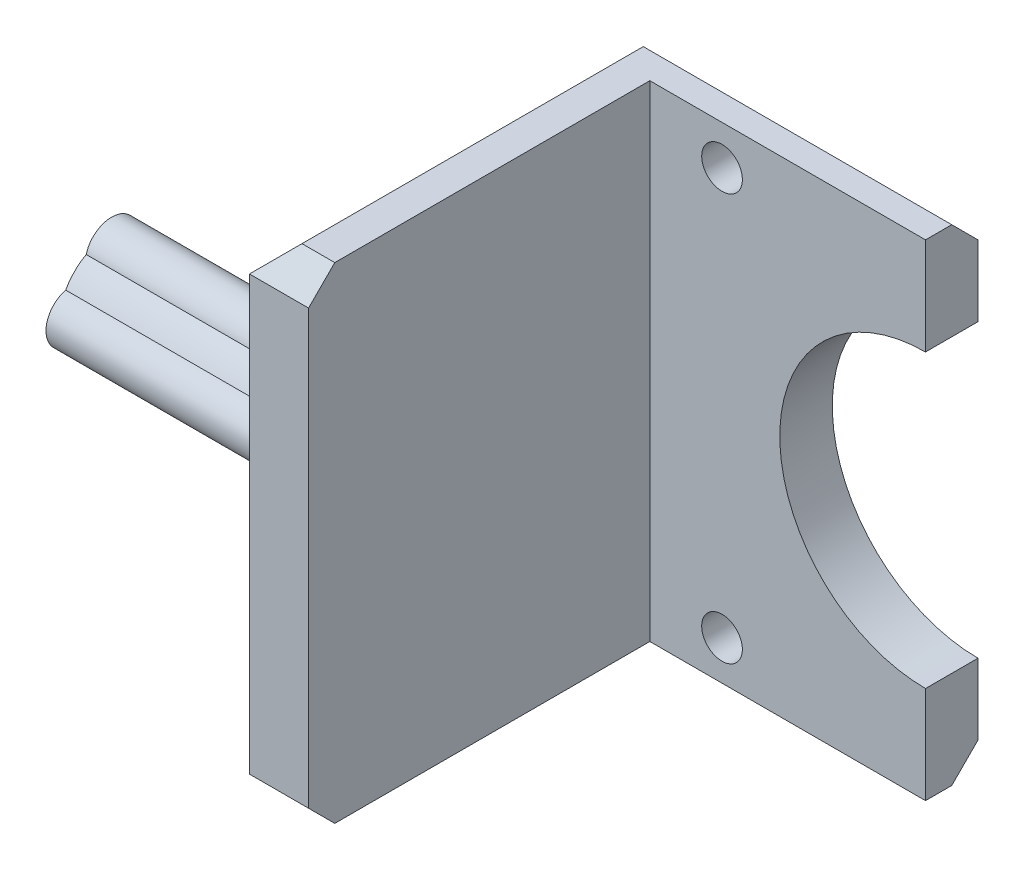
ISO-10303-21;
HEADER;
FILE_DESCRIPTION(('STEP AP214'),'2;1');
FILE_NAME('part.step','',(''),(''),'','','');
FILE_SCHEMA(('AUTOMOTIVE_DESIGN { 1 0 10303 214 1 1 1 1 }'));
ENDSEC;
DATA;
#1=APPLICATION_CONTEXT('core data for automotive mechanical design processes');
#2=APPLICATION_PROTOCOL_DEFINITION('international standard','automotive_design',2000,#1);
#3=PRODUCT_CONTEXT('',#1,'mechanical');
#4=PRODUCT('Part','Part','',(#3));
#5=PRODUCT_RELATED_PRODUCT_CATEGORY('part','',(#4));
#6=PRODUCT_DEFINITION_FORMATION('','',#4);
#7=PRODUCT_DEFINITION_CONTEXT('part definition',#1,'design');
#8=PRODUCT_DEFINITION('design','',#6,#7);
#9=PRODUCT_DEFINITION_SHAPE('','',#8);
#10=(LENGTH_UNIT() NAMED_UNIT(*) SI_UNIT(.MILLI.,.METRE.));
#11=(NAMED_UNIT(*) PLANE_ANGLE_UNIT() SI_UNIT($,.RADIAN.));
#12=(NAMED_UNIT(*) SI_UNIT($,.STERADIAN.) SOLID_ANGLE_UNIT());
#13=UNCERTAINTY_MEASURE_WITH_UNIT(LENGTH_MEASURE(1.E-05),#10,'distance_accuracy_value','');
#14=(GEOMETRIC_REPRESENTATION_CONTEXT(3) GLOBAL_UNCERTAINTY_ASSIGNED_CONTEXT((#13)) GLOBAL_UNIT_ASSIGNED_CONTEXT((#10,
#11,#12)) REPRESENTATION_CONTEXT('',''));
#15=CARTESIAN_POINT('',(0.,0.,0.));
#16=DIRECTION('',(0.,0.,1.));
#17=DIRECTION('',(1.,0.,0.));
#18=AXIS2_PLACEMENT_3D('',#15,#16,#17);
#19=CARTESIAN_POINT('',(-67.,18.5,-10.));
#20=DIRECTION('',(1.,0.,0.));
#21=DIRECTION('',(0.,0.,-1.));
#22=AXIS2_PLACEMENT_3D('',#19,#20,#21);
#23=CYLINDRICAL_SURFACE('',#22,4.);
#24=CARTESIAN_POINT('',(-47.,18.5,-10.));
#25=DIRECTION('',(-1.,0.,0.));
#26=DIRECTION('',(0.,0.,1.));
#27=AXIS2_PLACEMENT_3D('',#24,#25,#26);
#28=CIRCLE('',#27,4.);
#29=CARTESIAN_POINT('',(-47.,15.,-11.9364916731037));
#30=VERTEX_POINT('',#29);
#31=CARTESIAN_POINT('',(-47.,16.5635083268963,-13.5));
#32=VERTEX_POINT('',#31);
#33=EDGE_CURVE('E216',#30,#32,#28,.F.);
#34=ORIENTED_EDGE('',*,*,#33,.F.);
#35=DIRECTION('',(-1.,0.,0.));
#36=VECTOR('',#35,1.);
#37=CARTESIAN_POINT('',(-46.5,15.,-11.9364916731037));
#38=LINE('',#37,#36);
#39=CARTESIAN_POINT('',(-67.,15.,-11.9364916731037));
#40=VERTEX_POINT('',#39);
#41=EDGE_CURVE('E205',#30,#40,#38,.T.);
#42=ORIENTED_EDGE('',*,*,#41,.T.);
#43=CARTESIAN_POINT('',(-67.,18.5,-10.));
#44=DIRECTION('',(-1.,0.,0.));
#45=DIRECTION('',(0.,0.,1.));
#46=AXIS2_PLACEMENT_3D('',#43,#44,#45);
#47=CIRCLE('',#46,4.);
#48=CARTESIAN_POINT('',(-67.,16.5635083268963,-13.5));
#49=VERTEX_POINT('',#48);
#50=EDGE_CURVE('E380',#49,#40,#47,.T.);
#51=ORIENTED_EDGE('',*,*,#50,.F.);
#52=DIRECTION('',(-1.,0.,0.));
#53=VECTOR('',#52,1.);
#54=CARTESIAN_POINT('',(-46.5,16.5635083268963,-13.5));
#55=LINE('',#54,#53);
#56=EDGE_CURVE('E232',#32,#49,#55,.T.);
#57=ORIENTED_EDGE('',*,*,#56,.F.);
#58=EDGE_LOOP('',(#34,#42,#51,#57));
#59=FACE_BOUND('',#58,.T.);
#60=ADVANCED_FACE('F43',(#59),#23,.T.);
#61=CARTESIAN_POINT('',(-47.,0.,0.));
#62=DIRECTION('',(-1.,0.,0.));
#63=DIRECTION('',(0.,0.,1.));
#64=AXIS2_PLACEMENT_3D('',#61,#62,#63);
#65=PLANE('',#64);
#66=CARTESIAN_POINT('',(-47.,15.5,-10.));
#67=DIRECTION('',(-1.,0.,0.));
#68=DIRECTION('',(0.,0.,1.));
#69=AXIS2_PLACEMENT_3D('',#66,#67,#68);
#70=CIRCLE('',#69,2.);
#71=CARTESIAN_POINT('',(-47.,15.,-8.0635083268963));
#72=VERTEX_POINT('',#71);
#73=EDGE_CURVE('E209',#30,#72,#70,.T.);
#74=ORIENTED_EDGE('',*,*,#73,.F.);
#75=ORIENTED_EDGE('',*,*,#33,.T.);
#76=CARTESIAN_POINT('',(-47.,18.5,-13.));
#77=DIRECTION('',(-1.,0.,0.));
#78=DIRECTION('',(0.,0.,1.));
#79=AXIS2_PLACEMENT_3D('',#76,#77,#78);
#80=CIRCLE('',#79,2.);
#81=CARTESIAN_POINT('',(-47.,20.4364916731037,-13.5));
#82=VERTEX_POINT('',#81);
#83=EDGE_CURVE('E233',#32,#82,#80,.F.);
#84=ORIENTED_EDGE('',*,*,#83,.T.);
#85=CARTESIAN_POINT('',(-47.,22.,-11.9364916731037));
#86=VERTEX_POINT('',#85);
#87=EDGE_CURVE('E236',#82,#86,#28,.F.);
#88=ORIENTED_EDGE('',*,*,#87,.T.);
#89=CARTESIAN_POINT('',(-47.,21.5,-10.));
#90=DIRECTION('',(-1.,0.,0.));
#91=DIRECTION('',(0.,0.,1.));
#92=AXIS2_PLACEMENT_3D('',#89,#90,#91);
#93=CIRCLE('',#92,2.);
#94=CARTESIAN_POINT('',(-47.,22.,-8.0635083268963));
#95=VERTEX_POINT('',#94);
#96=EDGE_CURVE('E243',#86,#95,#93,.F.);
#97=ORIENTED_EDGE('',*,*,#96,.T.);
#98=CARTESIAN_POINT('',(-47.,20.4364916731037,-6.5));
#99=VERTEX_POINT('',#98);
#100=EDGE_CURVE('E235',#95,#99,#28,.F.);
#101=ORIENTED_EDGE('',*,*,#100,.T.);
#102=CARTESIAN_POINT('',(-47.,18.5,-7.));
#103=DIRECTION('',(-1.,0.,0.));
#104=DIRECTION('',(0.,0.,1.));
#105=AXIS2_PLACEMENT_3D('',#102,#103,#104);
#106=CIRCLE('',#105,2.);
#107=CARTESIAN_POINT('',(-47.,16.5635083268963,-6.5));
#108=VERTEX_POINT('',#107);
#109=EDGE_CURVE('E241',#99,#108,#106,.F.);
#110=ORIENTED_EDGE('',*,*,#109,.T.);
#111=EDGE_CURVE('E226',#108,#72,#28,.F.);
#112=ORIENTED_EDGE('',*,*,#111,.T.);
#113=EDGE_LOOP('',(#74,#75,#84,#88,#97,#101,#110,#112));
#114=FACE_BOUND('',#113,.T.);
#115=CARTESIAN_POINT('',(-47.,18.5,-10.));
#116=DIRECTION('',(-1.,0.,0.));
#117=DIRECTION('',(0.,0.,1.));
#118=AXIS2_PLACEMENT_3D('',#115,#116,#117);
#119=CIRCLE('',#118,8.5);
#120=CARTESIAN_POINT('',(-47.,18.5,-1.5));
#121=VERTEX_POINT('',#120);
#122=EDGE_CURVE('E240',#121,#121,#119,.T.);
#123=ORIENTED_EDGE('',*,*,#122,.T.);
#124=EDGE_LOOP('',(#123));
#125=FACE_BOUND('',#124,.T.);
#126=ADVANCED_FACE('F220',(#114,#125),#65,.T.);
#127=CARTESIAN_POINT('',(-67.,15.,-8.0635083268963));
#128=VERTEX_POINT('',#127);
#129=CARTESIAN_POINT('',(-67.,16.5635083268963,-6.5));
#130=VERTEX_POINT('',#129);
#131=EDGE_CURVE('E381',#128,#130,#47,.T.);
#132=ORIENTED_EDGE('',*,*,#131,.F.);
#133=DIRECTION('',(-1.,0.,0.));
#134=VECTOR('',#133,1.);
#135=CARTESIAN_POINT('',(-46.5,15.,-8.0635083268963));
#136=LINE('',#135,#134);
#137=EDGE_CURVE('E227',#72,#128,#136,.T.);
#138=ORIENTED_EDGE('',*,*,#137,.F.);
#139=ORIENTED_EDGE('',*,*,#111,.F.);
#140=DIRECTION('',(-1.,0.,0.));
#141=VECTOR('',#140,1.);
#142=CARTESIAN_POINT('',(-46.5,16.5635083268963,-6.5));
#143=LINE('',#142,#141);
#144=EDGE_CURVE('E384',#108,#130,#143,.T.);
#145=ORIENTED_EDGE('',*,*,#144,.T.);
#146=EDGE_LOOP('',(#132,#138,#139,#145));
#147=FACE_BOUND('',#146,.T.);
#148=ADVANCED_FACE('F470',(#147),#23,.T.);
#149=DIRECTION('',(-1.,0.,0.));
#150=VECTOR('',#149,1.);
#151=CARTESIAN_POINT('',(-46.5,20.4364916731037,-6.5));
#152=LINE('',#151,#150);
#153=CARTESIAN_POINT('',(-67.,20.4364916731037,-6.5));
#154=VERTEX_POINT('',#153);
#155=EDGE_CURVE('E393',#99,#154,#152,.T.);
#156=ORIENTED_EDGE('',*,*,#155,.F.);
#157=ORIENTED_EDGE('',*,*,#100,.F.);
#158=DIRECTION('',(-1.,0.,0.));
#159=VECTOR('',#158,1.);
#160=CARTESIAN_POINT('',(-56.75,22.,-8.06350832689629));
#161=LINE('',#160,#159);
#162=CARTESIAN_POINT('',(-67.,22.,-8.0635083268963));
#163=VERTEX_POINT('',#162);
#164=EDGE_CURVE('E259',#163,#95,#161,.F.);
#165=ORIENTED_EDGE('',*,*,#164,.F.);
#166=EDGE_CURVE('E273',#154,#163,#47,.T.);
#167=ORIENTED_EDGE('',*,*,#166,.F.);
#168=EDGE_LOOP('',(#156,#157,#165,#167));
#169=FACE_BOUND('',#168,.T.);
#170=ADVANCED_FACE('F477',(#169),#23,.T.);
#171=DIRECTION('',(-1.,0.,0.));
#172=VECTOR('',#171,1.);
#173=CARTESIAN_POINT('',(-46.5,20.4364916731037,-13.5));
#174=LINE('',#173,#172);
#175=CARTESIAN_POINT('',(-67.,20.4364916731037,-13.5));
#176=VERTEX_POINT('',#175);
#177=EDGE_CURVE('E353',#82,#176,#174,.T.);
#178=ORIENTED_EDGE('',*,*,#177,.T.);
#179=CARTESIAN_POINT('',(-67.,22.,-11.9364916731037));
#180=VERTEX_POINT('',#179);
#181=EDGE_CURVE('E262',#180,#176,#47,.T.);
#182=ORIENTED_EDGE('',*,*,#181,.F.);
#183=DIRECTION('',(-1.,0.,0.));
#184=VECTOR('',#183,1.);
#185=CARTESIAN_POINT('',(-56.75,22.,-11.9364916731037));
#186=LINE('',#185,#184);
#187=EDGE_CURVE('E256',#86,#180,#186,.T.);
#188=ORIENTED_EDGE('',*,*,#187,.F.);
#189=ORIENTED_EDGE('',*,*,#87,.F.);
#190=EDGE_LOOP('',(#178,#182,#188,#189));
#191=FACE_BOUND('',#190,.T.);
#192=ADVANCED_FACE('F260',(#191),#23,.T.);
#193=CARTESIAN_POINT('',(4.5,37.,0.));
#194=DIRECTION('',(0.,-1.,0.));
#195=DIRECTION('',(0.,0.,-1.));
#196=AXIS2_PLACEMENT_3D('',#193,#194,#195);
#197=PLANE('',#196);
#198=DIRECTION('',(1.,0.,0.));
#199=VECTOR('',#198,1.);
#200=CARTESIAN_POINT('',(-42.,37.,-26.));
#201=LINE('',#200,#199);
#202=CARTESIAN_POINT('',(-42.,37.,-26.));
#203=VERTEX_POINT('',#202);
#204=CARTESIAN_POINT('',(-21.,37.,-26.));
#205=VERTEX_POINT('',#204);
#206=EDGE_CURVE('E350',#203,#205,#201,.T.);
#207=ORIENTED_EDGE('',*,*,#206,.T.);
#208=DIRECTION('',(0.,0.,-1.));
#209=VECTOR('',#208,1.);
#210=CARTESIAN_POINT('',(-21.,37.,0.));
#211=LINE('',#210,#209);
#212=CARTESIAN_POINT('',(-21.,37.,-28.));
#213=VERTEX_POINT('',#212);
#214=EDGE_CURVE('E327',#205,#213,#211,.T.);
#215=ORIENTED_EDGE('',*,*,#214,.T.);
#216=DIRECTION('',(-1.,0.,0.));
#217=VECTOR('',#216,1.);
#218=CARTESIAN_POINT('',(4.5,37.,-28.));
#219=LINE('',#218,#217);
#220=CARTESIAN_POINT('',(-44.5,37.,-28.));
#221=VERTEX_POINT('',#220);
#222=EDGE_CURVE('E314',#213,#221,#219,.T.);
#223=ORIENTED_EDGE('',*,*,#222,.T.);
#224=DIRECTION('',(0.,0.,1.));
#225=VECTOR('',#224,1.);
#226=CARTESIAN_POINT('',(-44.5,37.,0.));
#227=LINE('',#226,#225);
#228=CARTESIAN_POINT('',(-44.5,37.,-2.));
#229=VERTEX_POINT('',#228);
#230=EDGE_CURVE('E311',#221,#229,#227,.T.);
#231=ORIENTED_EDGE('',*,*,#230,.T.);
#232=DIRECTION('',(1.,0.,0.));
#233=VECTOR('',#232,1.);
#234=CARTESIAN_POINT('',(4.5,37.,-2.));
#235=LINE('',#234,#233);
#236=CARTESIAN_POINT('',(-42.,37.,-2.));
#237=VERTEX_POINT('',#236);
#238=EDGE_CURVE('E313',#229,#237,#235,.T.);
#239=ORIENTED_EDGE('',*,*,#238,.T.);
#240=DIRECTION('',(0.,0.,-1.));
#241=VECTOR('',#240,1.);
#242=CARTESIAN_POINT('',(-42.,37.,0.));
#243=LINE('',#242,#241);
#244=EDGE_CURVE('E316',#237,#203,#243,.T.);
#245=ORIENTED_EDGE('',*,*,#244,.T.);
#246=EDGE_LOOP('',(#207,#215,#223,#231,#239,#245));
#247=FACE_BOUND('',#246,.T.);
#248=ADVANCED_FACE('F479',(#247),#197,.F.);
#249=CARTESIAN_POINT('',(4.5,0.,0.));
#250=DIRECTION('',(0.,1.,0.));
#251=DIRECTION('',(0.,0.,1.));
#252=AXIS2_PLACEMENT_3D('',#249,#250,#251);
#253=PLANE('',#252);
#254=DIRECTION('',(1.,0.,0.));
#255=VECTOR('',#254,1.);
#256=CARTESIAN_POINT('',(4.5,0.,-28.));
#257=LINE('',#256,#255);
#258=CARTESIAN_POINT('',(-44.5,0.,-28.));
#259=VERTEX_POINT('',#258);
#260=CARTESIAN_POINT('',(-21.,0.,-28.));
#261=VERTEX_POINT('',#260);
#262=EDGE_CURVE('E328',#259,#261,#257,.T.);
#263=ORIENTED_EDGE('',*,*,#262,.T.);
#264=DIRECTION('',(0.,0.,1.));
#265=VECTOR('',#264,1.);
#266=CARTESIAN_POINT('',(-21.,0.,0.));
#267=LINE('',#266,#265);
#268=CARTESIAN_POINT('',(-21.,0.,-26.));
#269=VERTEX_POINT('',#268);
#270=EDGE_CURVE('E90',#261,#269,#267,.T.);
#271=ORIENTED_EDGE('',*,*,#270,.T.);
#272=DIRECTION('',(1.,0.,0.));
#273=VECTOR('',#272,1.);
#274=CARTESIAN_POINT('',(-42.,0.,-26.));
#275=LINE('',#274,#273);
#276=CARTESIAN_POINT('',(-42.,0.,-26.));
#277=VERTEX_POINT('',#276);
#278=EDGE_CURVE('E344',#277,#269,#275,.T.);
#279=ORIENTED_EDGE('',*,*,#278,.F.);
#280=DIRECTION('',(0.,0.,1.));
#281=VECTOR('',#280,1.);
#282=CARTESIAN_POINT('',(-42.,0.,-30.));
#283=LINE('',#282,#281);
#284=CARTESIAN_POINT('',(-42.,0.,-2.00000000000002));
#285=VERTEX_POINT('',#284);
#286=EDGE_CURVE('E307',#277,#285,#283,.T.);
#287=ORIENTED_EDGE('',*,*,#286,.T.);
#288=DIRECTION('',(-1.,0.,0.));
#289=VECTOR('',#288,1.);
#290=CARTESIAN_POINT('',(4.5,0.,-2.00000000000002));
#291=LINE('',#290,#289);
#292=CARTESIAN_POINT('',(-44.5,0.,-2.00000000000002));
#293=VERTEX_POINT('',#292);
#294=EDGE_CURVE('E305',#285,#293,#291,.T.);
#295=ORIENTED_EDGE('',*,*,#294,.T.);
#296=DIRECTION('',(0.,0.,-1.));
#297=VECTOR('',#296,1.);
#298=CARTESIAN_POINT('',(-44.5,0.,-28.));
#299=LINE('',#298,#297);
#300=EDGE_CURVE('E302',#293,#259,#299,.T.);
#301=ORIENTED_EDGE('',*,*,#300,.T.);
#302=EDGE_LOOP('',(#263,#271,#279,#287,#295,#301));
#303=FACE_BOUND('',#302,.T.);
#304=ADVANCED_FACE('F423',(#303),#253,.F.);
#305=CARTESIAN_POINT('',(4.5,0.,-30.));
#306=DIRECTION('',(0.,0.,1.));
#307=DIRECTION('',(1.,0.,0.));
#308=AXIS2_PLACEMENT_3D('',#305,#306,#307);
#309=PLANE('',#308);
#310=DIRECTION('',(1.,0.,0.));
#311=VECTOR('',#310,1.);
#312=CARTESIAN_POINT('',(4.5,35.,-30.));
#313=LINE('',#312,#311);
#314=CARTESIAN_POINT('',(-35.3157280717673,35.,-30.));
#315=VERTEX_POINT('',#314);
#316=CARTESIAN_POINT('',(-21.,35.,-30.));
#317=VERTEX_POINT('',#316);
#318=EDGE_CURVE('E304',#315,#317,#313,.T.);
#319=ORIENTED_EDGE('',*,*,#318,.T.);
#320=DIRECTION('',(0.,-1.,0.));
#321=VECTOR('',#320,1.);
#322=CARTESIAN_POINT('',(-21.,0.,-30.));
#323=LINE('',#322,#321);
#324=CARTESIAN_POINT('',(-21.,29.6,-30.));
#325=VERTEX_POINT('',#324);
#326=EDGE_CURVE('E338',#317,#325,#323,.T.);
#327=ORIENTED_EDGE('',*,*,#326,.T.);
#328=CARTESIAN_POINT('',(-21.,18.5,-30.));
#329=DIRECTION('',(0.,0.,1.));
#330=DIRECTION('',(1.,0.,0.));
#331=AXIS2_PLACEMENT_3D('',#328,#329,#330);
#332=CIRCLE('',#331,11.1);
#333=CARTESIAN_POINT('',(-21.,7.4,-30.));
#334=VERTEX_POINT('',#333);
#335=EDGE_CURVE('E363',#334,#325,#332,.F.);
#336=ORIENTED_EDGE('',*,*,#335,.F.);
#337=CARTESIAN_POINT('',(-21.,2.00000000000002,-30.));
#338=VERTEX_POINT('',#337);
#339=EDGE_CURVE('E83',#334,#338,#323,.T.);
#340=ORIENTED_EDGE('',*,*,#339,.T.);
#341=DIRECTION('',(-1.,0.,0.));
#342=VECTOR('',#341,1.);
#343=CARTESIAN_POINT('',(4.5,2.00000000000002,-30.));
#344=LINE('',#343,#342);
#345=CARTESIAN_POINT('',(-35.3157280717673,2.00000000000002,-30.));
#346=VERTEX_POINT('',#345);
#347=EDGE_CURVE('E333',#338,#346,#344,.T.);
#348=ORIENTED_EDGE('',*,*,#347,.T.);
#349=CARTESIAN_POINT('',(-36.5,3.,-30.));
#350=DIRECTION('',(0.,0.,-1.));
#351=DIRECTION('',(-1.,0.,0.));
#352=AXIS2_PLACEMENT_3D('',#349,#350,#351);
#353=CIRCLE('',#352,1.55);
#354=CARTESIAN_POINT('',(-37.6842719282327,2.00000000000002,-30.));
#355=VERTEX_POINT('',#354);
#356=EDGE_CURVE('E332',#355,#346,#353,.T.);
#357=ORIENTED_EDGE('',*,*,#356,.F.);
#358=DIRECTION('',(-1.,0.,0.));
#359=VECTOR('',#358,1.);
#360=CARTESIAN_POINT('',(4.5,2.00000000000002,-30.));
#361=LINE('',#360,#359);
#362=CARTESIAN_POINT('',(-44.5,2.00000000000002,-30.));
#363=VERTEX_POINT('',#362);
#364=EDGE_CURVE('E335',#355,#363,#361,.T.);
#365=ORIENTED_EDGE('',*,*,#364,.T.);
#366=DIRECTION('',(0.,1.,0.));
#367=VECTOR('',#366,1.);
#368=CARTESIAN_POINT('',(-44.5,37.,-30.));
#369=LINE('',#368,#367);
#370=CARTESIAN_POINT('',(-44.5,35.,-30.));
#371=VERTEX_POINT('',#370);
#372=EDGE_CURVE('E341',#363,#371,#369,.T.);
#373=ORIENTED_EDGE('',*,*,#372,.T.);
#374=DIRECTION('',(1.,0.,0.));
#375=VECTOR('',#374,1.);
#376=CARTESIAN_POINT('',(4.5,35.,-30.));
#377=LINE('',#376,#375);
#378=CARTESIAN_POINT('',(-37.6842719282327,35.,-30.));
#379=VERTEX_POINT('',#378);
#380=EDGE_CURVE('E342',#371,#379,#377,.T.);
#381=ORIENTED_EDGE('',*,*,#380,.T.);
#382=CARTESIAN_POINT('',(-36.5,34.,-30.));
#383=DIRECTION('',(0.,0.,-1.));
#384=DIRECTION('',(-1.,0.,0.));
#385=AXIS2_PLACEMENT_3D('',#382,#383,#384);
#386=CIRCLE('',#385,1.54999999999999);
#387=EDGE_CURVE('E325',#315,#379,#386,.T.);
#388=ORIENTED_EDGE('',*,*,#387,.F.);
#389=EDGE_LOOP('',(#319,#327,#336,#340,#348,#357,#365,#373,#381,#388));
#390=FACE_BOUND('',#389,.T.);
#391=ADVANCED_FACE('F409',(#390),#309,.F.);
#392=CARTESIAN_POINT('',(-42.,37.,-26.));
#393=DIRECTION('',(0.,0.,-1.));
#394=DIRECTION('',(-1.,0.,0.));
#395=AXIS2_PLACEMENT_3D('',#392,#393,#394);
#396=PLANE('',#395);
#397=CARTESIAN_POINT('',(-36.5,3.,-26.));
#398=DIRECTION('',(0.,0.,-1.));
#399=DIRECTION('',(-1.,0.,0.));
#400=AXIS2_PLACEMENT_3D('',#397,#398,#399);
#401=CIRCLE('',#400,1.55);
#402=CARTESIAN_POINT('',(-38.05,3.,-26.));
#403=VERTEX_POINT('',#402);
#404=EDGE_CURVE('E324',#403,#403,#401,.F.);
#405=ORIENTED_EDGE('',*,*,#404,.F.);
#406=EDGE_LOOP('',(#405));
#407=FACE_BOUND('',#406,.T.);
#408=CARTESIAN_POINT('',(-36.5,34.,-26.));
#409=DIRECTION('',(0.,0.,-1.));
#410=DIRECTION('',(-1.,0.,0.));
#411=AXIS2_PLACEMENT_3D('',#408,#409,#410);
#412=CIRCLE('',#411,1.54999999999999);
#413=CARTESIAN_POINT('',(-38.05,34.,-26.));
#414=VERTEX_POINT('',#413);
#415=EDGE_CURVE('E374',#414,#414,#412,.F.);
#416=ORIENTED_EDGE('',*,*,#415,.F.);
#417=EDGE_LOOP('',(#416));
#418=FACE_BOUND('',#417,.T.);
#419=ORIENTED_EDGE('',*,*,#278,.T.);
#420=DIRECTION('',(0.,1.,0.));
#421=VECTOR('',#420,1.);
#422=CARTESIAN_POINT('',(-21.,37.,-26.));
#423=LINE('',#422,#421);
#424=CARTESIAN_POINT('',(-21.,7.4,-26.));
#425=VERTEX_POINT('',#424);
#426=EDGE_CURVE('E349',#269,#425,#423,.T.);
#427=ORIENTED_EDGE('',*,*,#426,.T.);
#428=CARTESIAN_POINT('',(-21.,18.5,-26.));
#429=DIRECTION('',(0.,0.,1.));
#430=DIRECTION('',(1.,0.,0.));
#431=AXIS2_PLACEMENT_3D('',#428,#429,#430);
#432=CIRCLE('',#431,11.1);
#433=CARTESIAN_POINT('',(-21.,29.6,-26.));
#434=VERTEX_POINT('',#433);
#435=EDGE_CURVE('E301',#434,#425,#432,.T.);
#436=ORIENTED_EDGE('',*,*,#435,.F.);
#437=EDGE_CURVE('E61',#434,#205,#423,.T.);
#438=ORIENTED_EDGE('',*,*,#437,.T.);
#439=ORIENTED_EDGE('',*,*,#206,.F.);
#440=DIRECTION('',(0.,1.,0.));
#441=VECTOR('',#440,1.);
#442=CARTESIAN_POINT('',(-42.,37.,-26.));
#443=LINE('',#442,#441);
#444=EDGE_CURVE('E276',#277,#203,#443,.T.);
#445=ORIENTED_EDGE('',*,*,#444,.F.);
#446=EDGE_LOOP('',(#419,#427,#436,#438,#439,#445));
#447=FACE_BOUND('',#446,.T.);
#448=ADVANCED_FACE('F418',(#407,#418,#447),#396,.F.);
#449=CARTESIAN_POINT('',(-42.,0.,0.));
#450=DIRECTION('',(-1.,0.,0.));
#451=DIRECTION('',(0.,0.,1.));
#452=AXIS2_PLACEMENT_3D('',#449,#450,#451);
#453=PLANE('',#452);
#454=DIRECTION('',(0.,1.,0.));
#455=VECTOR('',#454,1.);
#456=CARTESIAN_POINT('',(-42.,0.,0.));
#457=LINE('',#456,#455);
#458=CARTESIAN_POINT('',(-42.,2.,0.));
#459=VERTEX_POINT('',#458);
#460=CARTESIAN_POINT('',(-42.,35.,0.));
#461=VERTEX_POINT('',#460);
#462=EDGE_CURVE('E281',#459,#461,#457,.T.);
#463=ORIENTED_EDGE('',*,*,#462,.F.);
#464=DIRECTION('',(0.,0.707106781186545,0.70710678118655));
#465=VECTOR('',#464,1.);
#466=CARTESIAN_POINT('',(-42.,2.,0.));
#467=LINE('',#466,#465);
#468=EDGE_CURVE('E274',#459,#285,#467,.F.);
#469=ORIENTED_EDGE('',*,*,#468,.T.);
#470=ORIENTED_EDGE('',*,*,#286,.F.);
#471=ORIENTED_EDGE('',*,*,#444,.T.);
#472=ORIENTED_EDGE('',*,*,#244,.F.);
#473=DIRECTION('',(0.,0.70710678118655,-0.707106781186545));
#474=VECTOR('',#473,1.);
#475=CARTESIAN_POINT('',(-42.,37.,-2.));
#476=LINE('',#475,#474);
#477=EDGE_CURVE('E277',#237,#461,#476,.F.);
#478=ORIENTED_EDGE('',*,*,#477,.T.);
#479=EDGE_LOOP('',(#463,#469,#470,#471,#472,#478));
#480=FACE_BOUND('',#479,.T.);
#481=ADVANCED_FACE('F549',(#480),#453,.F.);
#482=CARTESIAN_POINT('',(-46.5,0.,0.));
#483=DIRECTION('',(0.,0.,-1.));
#484=DIRECTION('',(-1.,0.,0.));
#485=AXIS2_PLACEMENT_3D('',#482,#483,#484);
#486=PLANE('',#485);
#487=DIRECTION('',(0.,1.,0.));
#488=VECTOR('',#487,1.);
#489=CARTESIAN_POINT('',(-46.5,0.,0.));
#490=LINE('',#489,#488);
#491=CARTESIAN_POINT('',(-46.5,2.,0.));
#492=VERTEX_POINT('',#491);
#493=CARTESIAN_POINT('',(-46.5,35.,0.));
#494=VERTEX_POINT('',#493);
#495=EDGE_CURVE('E297',#492,#494,#490,.T.);
#496=ORIENTED_EDGE('',*,*,#495,.F.);
#497=DIRECTION('',(1.,0.,0.));
#498=VECTOR('',#497,1.);
#499=CARTESIAN_POINT('',(-46.5,2.,0.));
#500=LINE('',#499,#498);
#501=EDGE_CURVE('E279',#492,#459,#500,.T.);
#502=ORIENTED_EDGE('',*,*,#501,.T.);
#503=ORIENTED_EDGE('',*,*,#462,.T.);
#504=DIRECTION('',(-1.,0.,0.));
#505=VECTOR('',#504,1.);
#506=CARTESIAN_POINT('',(-46.5,35.,0.));
#507=LINE('',#506,#505);
#508=EDGE_CURVE('E282',#461,#494,#507,.T.);
#509=ORIENTED_EDGE('',*,*,#508,.T.);
#510=EDGE_LOOP('',(#496,#502,#503,#509));
#511=FACE_BOUND('',#510,.T.);
#512=ADVANCED_FACE('F551',(#511),#486,.F.);
#513=CARTESIAN_POINT('',(-46.5,0.,0.));
#514=DIRECTION('',(-1.,0.,0.));
#515=DIRECTION('',(0.,0.,1.));
#516=AXIS2_PLACEMENT_3D('',#513,#514,#515);
#517=PLANE('',#516);
#518=CARTESIAN_POINT('',(-46.5,18.5,-10.));
#519=DIRECTION('',(-1.,0.,0.));
#520=DIRECTION('',(0.,0.,1.));
#521=AXIS2_PLACEMENT_3D('',#518,#519,#520);
#522=CIRCLE('',#521,8.5);
#523=CARTESIAN_POINT('',(-46.5,18.5,-1.5));
#524=VERTEX_POINT('',#523);
#525=EDGE_CURVE('E319',#524,#524,#522,.T.);
#526=ORIENTED_EDGE('',*,*,#525,.F.);
#527=EDGE_LOOP('',(#526));
#528=FACE_BOUND('',#527,.T.);
#529=DIRECTION('',(0.,-1.,0.));
#530=VECTOR('',#529,1.);
#531=CARTESIAN_POINT('',(-46.5,0.,-28.));
#532=LINE('',#531,#530);
#533=CARTESIAN_POINT('',(-46.5,35.,-28.));
#534=VERTEX_POINT('',#533);
#535=CARTESIAN_POINT('',(-46.5,2.,-28.));
#536=VERTEX_POINT('',#535);
#537=EDGE_CURVE('E284',#534,#536,#532,.T.);
#538=ORIENTED_EDGE('',*,*,#537,.T.);
#539=DIRECTION('',(0.,0.,1.));
#540=VECTOR('',#539,1.);
#541=CARTESIAN_POINT('',(-46.5,2.,0.));
#542=LINE('',#541,#540);
#543=EDGE_CURVE('E294',#536,#492,#542,.T.);
#544=ORIENTED_EDGE('',*,*,#543,.T.);
#545=ORIENTED_EDGE('',*,*,#495,.T.);
#546=DIRECTION('',(0.,0.,-1.));
#547=VECTOR('',#546,1.);
#548=CARTESIAN_POINT('',(-46.5,35.,-28.));
#549=LINE('',#548,#547);
#550=EDGE_CURVE('E298',#494,#534,#549,.T.);
#551=ORIENTED_EDGE('',*,*,#550,.T.);
#552=EDGE_LOOP('',(#538,#544,#545,#551));
#553=FACE_BOUND('',#552,.T.);
#554=ADVANCED_FACE('F441',(#528,#553),#517,.T.);
#555=CARTESIAN_POINT('',(-21.,18.5,-61.3955410846827));
#556=DIRECTION('',(0.,0.,1.));
#557=DIRECTION('',(1.,0.,0.));
#558=AXIS2_PLACEMENT_3D('',#555,#556,#557);
#559=CYLINDRICAL_SURFACE('',#558,11.1);
#560=ORIENTED_EDGE('',*,*,#435,.T.);
#561=DIRECTION('',(0.,0.,1.));
#562=VECTOR('',#561,1.);
#563=CARTESIAN_POINT('',(-21.,7.4,-61.3955410846827));
#564=LINE('',#563,#562);
#565=EDGE_CURVE('E367',#425,#334,#564,.F.);
#566=ORIENTED_EDGE('',*,*,#565,.T.);
#567=ORIENTED_EDGE('',*,*,#335,.T.);
#568=DIRECTION('',(0.,0.,1.));
#569=VECTOR('',#568,1.);
#570=CARTESIAN_POINT('',(-21.,29.6,-61.3955410846827));
#571=LINE('',#570,#569);
#572=EDGE_CURVE('E366',#325,#434,#571,.T.);
#573=ORIENTED_EDGE('',*,*,#572,.T.);
#574=EDGE_LOOP('',(#560,#566,#567,#573));
#575=FACE_BOUND('',#574,.T.);
#576=ADVANCED_FACE('F414',(#575),#559,.F.);
#577=CARTESIAN_POINT('',(-36.5,34.,-21.6159379566434));
#578=DIRECTION('',(0.,0.,-1.));
#579=DIRECTION('',(-1.,0.,0.));
#580=AXIS2_PLACEMENT_3D('',#577,#578,#579);
#581=CYLINDRICAL_SURFACE('',#580,1.54999999999999);
#582=ORIENTED_EDGE('',*,*,#415,.T.);
#583=EDGE_LOOP('',(#582));
#584=FACE_BOUND('',#583,.T.);
#585=ORIENTED_EDGE('',*,*,#387,.T.);
#586=CARTESIAN_POINT('',(-36.5,34.,-31.));
#587=DIRECTION('',(0.,-0.707106781186545,0.70710678118655));
#588=DIRECTION('',(0.,-0.70710678118655,-0.707106781186545));
#589=AXIS2_PLACEMENT_3D('',#586,#587,#588);
#590=ELLIPSE('',#589,2.19203102167828,1.54999999999999);
#591=EDGE_CURVE('E322',#379,#315,#590,.F.);
#592=ORIENTED_EDGE('',*,*,#591,.T.);
#593=EDGE_LOOP('',(#585,#592));
#594=FACE_BOUND('',#593,.T.);
#595=ADVANCED_FACE('F456',(#584,#594),#581,.F.);
#596=CARTESIAN_POINT('',(-36.5,3.,-21.6159379566434));
#597=DIRECTION('',(0.,0.,-1.));
#598=DIRECTION('',(-1.,0.,0.));
#599=AXIS2_PLACEMENT_3D('',#596,#597,#598);
#600=CYLINDRICAL_SURFACE('',#599,1.55);
#601=ORIENTED_EDGE('',*,*,#404,.T.);
#602=EDGE_LOOP('',(#601));
#603=FACE_BOUND('',#602,.T.);
#604=ORIENTED_EDGE('',*,*,#356,.T.);
#605=CARTESIAN_POINT('',(-36.5,3.,-31.));
#606=DIRECTION('',(0.,0.707106781186545,0.70710678118655));
#607=DIRECTION('',(0.,0.70710678118655,-0.707106781186545));
#608=AXIS2_PLACEMENT_3D('',#605,#606,#607);
#609=ELLIPSE('',#608,2.19203102167829,1.55);
#610=EDGE_CURVE('E310',#346,#355,#609,.F.);
#611=ORIENTED_EDGE('',*,*,#610,.T.);
#612=EDGE_LOOP('',(#604,#611));
#613=FACE_BOUND('',#612,.T.);
#614=ADVANCED_FACE('F458',(#603,#613),#600,.F.);
#615=CARTESIAN_POINT('',(4.5,37.,-28.));
#616=DIRECTION('',(0.,-0.707106781186545,0.70710678118655));
#617=DIRECTION('',(-1.,0.,0.));
#618=AXIS2_PLACEMENT_3D('',#615,#616,#617);
#619=PLANE('',#618);
#620=DIRECTION('',(0.,-0.70710678118655,-0.707106781186545));
#621=VECTOR('',#620,1.);
#622=CARTESIAN_POINT('',(-21.,37.,-28.));
#623=LINE('',#622,#621);
#624=EDGE_CURVE('E11',#317,#213,#623,.F.);
#625=ORIENTED_EDGE('',*,*,#624,.F.);
#626=ORIENTED_EDGE('',*,*,#318,.F.);
#627=ORIENTED_EDGE('',*,*,#591,.F.);
#628=ORIENTED_EDGE('',*,*,#380,.F.);
#629=DIRECTION('',(-0.577350269189627,0.577350269189627,0.577350269189623));
#630=VECTOR('',#629,1.);
#631=CARTESIAN_POINT('',(-34.1666666666666,24.6666666666666,-40.3333333333333));
#632=LINE('',#631,#630);
#633=CARTESIAN_POINT('',(-45.5,36.,-29.));
#634=VERTEX_POINT('',#633);
#635=EDGE_CURVE('E290',#634,#371,#632,.F.);
#636=ORIENTED_EDGE('',*,*,#635,.F.);
#637=DIRECTION('',(-0.577350269189624,-0.577350269189628,-0.577350269189624));
#638=VECTOR('',#637,1.);
#639=CARTESIAN_POINT('',(-28.1666666666667,53.3333333333334,-11.6666666666667));
#640=LINE('',#639,#638);
#641=EDGE_CURVE('E288',#634,#221,#640,.F.);
#642=ORIENTED_EDGE('',*,*,#641,.T.);
#643=ORIENTED_EDGE('',*,*,#222,.F.);
#644=EDGE_LOOP('',(#625,#626,#627,#628,#636,#642,#643));
#645=FACE_BOUND('',#644,.T.);
#646=ADVANCED_FACE('F452',(#645),#619,.F.);
#647=CARTESIAN_POINT('',(-46.5,0.,-28.));
#648=DIRECTION('',(-0.707106781186545,0.,-0.70710678118655));
#649=DIRECTION('',(0.,1.,0.));
#650=AXIS2_PLACEMENT_3D('',#647,#648,#649);
#651=PLANE('',#650);
#652=DIRECTION('',(0.577350269189627,0.577350269189627,-0.577350269189623));
#653=VECTOR('',#652,1.);
#654=CARTESIAN_POINT('',(-46.5,0.,-28.));
#655=LINE('',#654,#653);
#656=CARTESIAN_POINT('',(-45.5,1.,-29.));
#657=VERTEX_POINT('',#656);
#658=EDGE_CURVE('E293',#657,#363,#655,.T.);
#659=ORIENTED_EDGE('',*,*,#658,.F.);
#660=DIRECTION('',(-0.577350269189628,0.577350269189624,0.577350269189624));
#661=VECTOR('',#660,1.);
#662=CARTESIAN_POINT('',(-45.8333333333333,1.33333333333334,-28.6666666666667));
#663=LINE('',#662,#661);
#664=EDGE_CURVE('E285',#657,#536,#663,.T.);
#665=ORIENTED_EDGE('',*,*,#664,.T.);
#666=ORIENTED_EDGE('',*,*,#537,.F.);
#667=DIRECTION('',(0.577350269189626,0.57735026918963,-0.577350269189622));
#668=VECTOR('',#667,1.);
#669=CARTESIAN_POINT('',(-58.1666666666667,23.3333333333332,-16.3333333333333));
#670=LINE('',#669,#668);
#671=EDGE_CURVE('E287',#534,#634,#670,.T.);
#672=ORIENTED_EDGE('',*,*,#671,.T.);
#673=ORIENTED_EDGE('',*,*,#635,.T.);
#674=ORIENTED_EDGE('',*,*,#372,.F.);
#675=EDGE_LOOP('',(#659,#665,#666,#672,#673,#674));
#676=FACE_BOUND('',#675,.T.);
#677=ADVANCED_FACE('F438',(#676),#651,.T.);
#678=CARTESIAN_POINT('',(4.5,2.00000000000002,-30.));
#679=DIRECTION('',(0.,0.707106781186545,0.70710678118655));
#680=DIRECTION('',(-1.,0.,0.));
#681=AXIS2_PLACEMENT_3D('',#678,#679,#680);
#682=PLANE('',#681);
#683=DIRECTION('',(0.,-0.70710678118655,0.707106781186545));
#684=VECTOR('',#683,1.);
#685=CARTESIAN_POINT('',(-21.,2.00000000000002,-30.));
#686=LINE('',#685,#684);
#687=EDGE_CURVE('E47',#261,#338,#686,.F.);
#688=ORIENTED_EDGE('',*,*,#687,.F.);
#689=ORIENTED_EDGE('',*,*,#262,.F.);
#690=DIRECTION('',(0.57735026918963,-0.577350269189626,0.577350269189622));
#691=VECTOR('',#690,1.);
#692=CARTESIAN_POINT('',(-29.4999999999998,-15.0000000000001,-13.));
#693=LINE('',#692,#691);
#694=EDGE_CURVE('E291',#259,#657,#693,.F.);
#695=ORIENTED_EDGE('',*,*,#694,.T.);
#696=ORIENTED_EDGE('',*,*,#658,.T.);
#697=ORIENTED_EDGE('',*,*,#364,.F.);
#698=ORIENTED_EDGE('',*,*,#610,.F.);
#699=ORIENTED_EDGE('',*,*,#347,.F.);
#700=EDGE_LOOP('',(#688,#689,#695,#696,#697,#698,#699));
#701=FACE_BOUND('',#700,.T.);
#702=ADVANCED_FACE('F429',(#701),#682,.F.);
#703=CARTESIAN_POINT('',(-47.,18.5,-10.));
#704=DIRECTION('',(1.,0.,0.));
#705=DIRECTION('',(0.,0.,-1.));
#706=AXIS2_PLACEMENT_3D('',#703,#704,#705);
#707=CYLINDRICAL_SURFACE('',#706,8.5);
#708=ORIENTED_EDGE('',*,*,#122,.F.);
#709=EDGE_LOOP('',(#708));
#710=FACE_BOUND('',#709,.T.);
#711=ORIENTED_EDGE('',*,*,#525,.T.);
#712=EDGE_LOOP('',(#711));
#713=FACE_BOUND('',#712,.T.);
#714=ADVANCED_FACE('F511',(#710,#713),#707,.T.);
#715=CARTESIAN_POINT('',(-67.,18.5,-10.));
#716=DIRECTION('',(-1.,0.,0.));
#717=DIRECTION('',(0.,0.,1.));
#718=AXIS2_PLACEMENT_3D('',#715,#716,#717);
#719=PLANE('',#718);
#720=ORIENTED_EDGE('',*,*,#181,.T.);
#721=CARTESIAN_POINT('',(-67.,18.5,-13.));
#722=DIRECTION('',(-1.,0.,0.));
#723=DIRECTION('',(0.,0.,1.));
#724=AXIS2_PLACEMENT_3D('',#721,#722,#723);
#725=CIRCLE('',#724,2.);
#726=EDGE_CURVE('E493',#49,#176,#725,.F.);
#727=ORIENTED_EDGE('',*,*,#726,.F.);
#728=ORIENTED_EDGE('',*,*,#50,.T.);
#729=CARTESIAN_POINT('',(-67.,15.5,-10.));
#730=DIRECTION('',(-1.,0.,0.));
#731=DIRECTION('',(0.,0.,1.));
#732=AXIS2_PLACEMENT_3D('',#729,#730,#731);
#733=CIRCLE('',#732,2.);
#734=EDGE_CURVE('E211',#40,#128,#733,.T.);
#735=ORIENTED_EDGE('',*,*,#734,.T.);
#736=ORIENTED_EDGE('',*,*,#131,.T.);
#737=CARTESIAN_POINT('',(-67.,18.5,-7.));
#738=DIRECTION('',(-1.,0.,0.));
#739=DIRECTION('',(0.,0.,1.));
#740=AXIS2_PLACEMENT_3D('',#737,#738,#739);
#741=CIRCLE('',#740,2.);
#742=EDGE_CURVE('E228',#154,#130,#741,.F.);
#743=ORIENTED_EDGE('',*,*,#742,.F.);
#744=ORIENTED_EDGE('',*,*,#166,.T.);
#745=CARTESIAN_POINT('',(-67.,21.5,-10.));
#746=DIRECTION('',(-1.,0.,0.));
#747=DIRECTION('',(0.,0.,1.));
#748=AXIS2_PLACEMENT_3D('',#745,#746,#747);
#749=CIRCLE('',#748,2.);
#750=EDGE_CURVE('E263',#180,#163,#749,.F.);
#751=ORIENTED_EDGE('',*,*,#750,.F.);
#752=EDGE_LOOP('',(#720,#727,#728,#735,#736,#743,#744,#751));
#753=FACE_BOUND('',#752,.T.);
#754=ADVANCED_FACE('F499',(#753),#719,.T.);
#755=CARTESIAN_POINT('',(-46.5,2.,0.));
#756=DIRECTION('',(0.,0.70710678118655,-0.707106781186545));
#757=DIRECTION('',(1.,0.,0.));
#758=AXIS2_PLACEMENT_3D('',#755,#756,#757);
#759=PLANE('',#758);
#760=ORIENTED_EDGE('',*,*,#468,.F.);
#761=ORIENTED_EDGE('',*,*,#501,.F.);
#762=DIRECTION('',(-0.577350269189627,0.577350269189623,0.577350269189627));
#763=VECTOR('',#762,1.);
#764=CARTESIAN_POINT('',(-46.5,2.,0.));
#765=LINE('',#764,#763);
#766=EDGE_CURVE('E268',#293,#492,#765,.T.);
#767=ORIENTED_EDGE('',*,*,#766,.F.);
#768=ORIENTED_EDGE('',*,*,#294,.F.);
#769=EDGE_LOOP('',(#760,#761,#767,#768));
#770=FACE_BOUND('',#769,.T.);
#771=ADVANCED_FACE('F515',(#770),#759,.F.);
#772=CARTESIAN_POINT('',(-46.5,2.,0.));
#773=DIRECTION('',(-0.707106781186545,-0.70710678118655,0.));
#774=DIRECTION('',(0.,0.,-1.));
#775=AXIS2_PLACEMENT_3D('',#772,#773,#774);
#776=PLANE('',#775);
#777=ORIENTED_EDGE('',*,*,#694,.F.);
#778=ORIENTED_EDGE('',*,*,#300,.F.);
#779=ORIENTED_EDGE('',*,*,#766,.T.);
#780=ORIENTED_EDGE('',*,*,#543,.F.);
#781=ORIENTED_EDGE('',*,*,#664,.F.);
#782=EDGE_LOOP('',(#777,#778,#779,#780,#781));
#783=FACE_BOUND('',#782,.T.);
#784=ADVANCED_FACE('F433',(#783),#776,.T.);
#785=CARTESIAN_POINT('',(4.5,37.,-2.));
#786=DIRECTION('',(0.,-0.707106781186545,-0.70710678118655));
#787=DIRECTION('',(1.,0.,0.));
#788=AXIS2_PLACEMENT_3D('',#785,#786,#787);
#789=PLANE('',#788);
#790=ORIENTED_EDGE('',*,*,#477,.F.);
#791=ORIENTED_EDGE('',*,*,#238,.F.);
#792=DIRECTION('',(0.577350269189624,0.577350269189628,-0.577350269189624));
#793=VECTOR('',#792,1.);
#794=CARTESIAN_POINT('',(-28.1666666666667,53.3333333333334,-18.3333333333333));
#795=LINE('',#794,#793);
#796=EDGE_CURVE('E264',#494,#229,#795,.T.);
#797=ORIENTED_EDGE('',*,*,#796,.F.);
#798=ORIENTED_EDGE('',*,*,#508,.F.);
#799=EDGE_LOOP('',(#790,#791,#797,#798));
#800=FACE_BOUND('',#799,.T.);
#801=ADVANCED_FACE('F524',(#800),#789,.F.);
#802=CARTESIAN_POINT('',(-46.5,35.,0.));
#803=DIRECTION('',(-0.70710678118655,0.707106781186545,0.));
#804=DIRECTION('',(0.,0.,1.));
#805=AXIS2_PLACEMENT_3D('',#802,#803,#804);
#806=PLANE('',#805);
#807=ORIENTED_EDGE('',*,*,#796,.T.);
#808=ORIENTED_EDGE('',*,*,#230,.F.);
#809=ORIENTED_EDGE('',*,*,#641,.F.);
#810=ORIENTED_EDGE('',*,*,#671,.F.);
#811=ORIENTED_EDGE('',*,*,#550,.F.);
#812=EDGE_LOOP('',(#807,#808,#809,#810,#811));
#813=FACE_BOUND('',#812,.T.);
#814=ADVANCED_FACE('F446',(#813),#806,.T.);
#815=CARTESIAN_POINT('',(-46.5,21.5,-10.));
#816=DIRECTION('',(-1.,0.,0.));
#817=DIRECTION('',(0.,0.,1.));
#818=AXIS2_PLACEMENT_3D('',#815,#816,#817);
#819=CYLINDRICAL_SURFACE('',#818,2.);
#820=ORIENTED_EDGE('',*,*,#96,.F.);
#821=ORIENTED_EDGE('',*,*,#187,.T.);
#822=ORIENTED_EDGE('',*,*,#750,.T.);
#823=ORIENTED_EDGE('',*,*,#164,.T.);
#824=EDGE_LOOP('',(#820,#821,#822,#823));
#825=FACE_BOUND('',#824,.T.);
#826=ADVANCED_FACE('F254',(#825),#819,.T.);
#827=CARTESIAN_POINT('',(-46.5,18.5,-13.));
#828=DIRECTION('',(-1.,0.,0.));
#829=DIRECTION('',(0.,0.,1.));
#830=AXIS2_PLACEMENT_3D('',#827,#828,#829);
#831=CYLINDRICAL_SURFACE('',#830,2.);
#832=ORIENTED_EDGE('',*,*,#83,.F.);
#833=ORIENTED_EDGE('',*,*,#56,.T.);
#834=ORIENTED_EDGE('',*,*,#726,.T.);
#835=ORIENTED_EDGE('',*,*,#177,.F.);
#836=EDGE_LOOP('',(#832,#833,#834,#835));
#837=FACE_BOUND('',#836,.T.);
#838=ADVANCED_FACE('F497',(#837),#831,.T.);
#839=CARTESIAN_POINT('',(-46.5,18.5,-7.));
#840=DIRECTION('',(-1.,0.,0.));
#841=DIRECTION('',(0.,0.,1.));
#842=AXIS2_PLACEMENT_3D('',#839,#840,#841);
#843=CYLINDRICAL_SURFACE('',#842,2.);
#844=ORIENTED_EDGE('',*,*,#109,.F.);
#845=ORIENTED_EDGE('',*,*,#155,.T.);
#846=ORIENTED_EDGE('',*,*,#742,.T.);
#847=ORIENTED_EDGE('',*,*,#144,.F.);
#848=EDGE_LOOP('',(#844,#845,#846,#847));
#849=FACE_BOUND('',#848,.T.);
#850=ADVANCED_FACE('F500',(#849),#843,.T.);
#851=CARTESIAN_POINT('',(-46.5,15.5,-10.));
#852=DIRECTION('',(-1.,0.,0.));
#853=DIRECTION('',(0.,0.,1.));
#854=AXIS2_PLACEMENT_3D('',#851,#852,#853);
#855=CYLINDRICAL_SURFACE('',#854,2.);
#856=ORIENTED_EDGE('',*,*,#41,.F.);
#857=ORIENTED_EDGE('',*,*,#73,.T.);
#858=ORIENTED_EDGE('',*,*,#137,.T.);
#859=ORIENTED_EDGE('',*,*,#734,.F.);
#860=EDGE_LOOP('',(#856,#857,#858,#859));
#861=FACE_BOUND('',#860,.T.);
#862=ADVANCED_FACE('F207',(#861),#855,.T.);
#863=CARTESIAN_POINT('',(-21.,0.,0.));
#864=DIRECTION('',(-1.,0.,0.));
#865=DIRECTION('',(0.,0.,1.));
#866=AXIS2_PLACEMENT_3D('',#863,#864,#865);
#867=PLANE('',#866);
#868=ORIENTED_EDGE('',*,*,#270,.F.);
#869=ORIENTED_EDGE('',*,*,#687,.T.);
#870=ORIENTED_EDGE('',*,*,#339,.F.);
#871=ORIENTED_EDGE('',*,*,#565,.F.);
#872=ORIENTED_EDGE('',*,*,#426,.F.);
#873=EDGE_LOOP('',(#868,#869,#870,#871,#872));
#874=FACE_BOUND('',#873,.T.);
#875=ADVANCED_FACE('F416',(#874),#867,.F.);
#876=ORIENTED_EDGE('',*,*,#572,.F.);
#877=ORIENTED_EDGE('',*,*,#326,.F.);
#878=ORIENTED_EDGE('',*,*,#624,.T.);
#879=ORIENTED_EDGE('',*,*,#214,.F.);
#880=ORIENTED_EDGE('',*,*,#437,.F.);
#881=EDGE_LOOP('',(#876,#877,#878,#879,#880));
#882=FACE_BOUND('',#881,.T.);
#883=ADVANCED_FACE('F45',(#882),#867,.F.);
#884=CLOSED_SHELL('',(#60,#126,#148,#170,#192,#248,#304,#391,#448,#481,#512,#554,#576,#595,#614,
#646,#677,#702,#714,#754,#771,#784,#801,#814,#826,#838,#850,#862,#875,#883));
#885=MANIFOLD_SOLID_BREP('B2',#884);
#886=ADVANCED_BREP_SHAPE_REPRESENTATION('',(#18,#885),#14);
#887=SHAPE_DEFINITION_REPRESENTATION(#9,#886);
ENDSEC;
END-ISO-10303-21;
